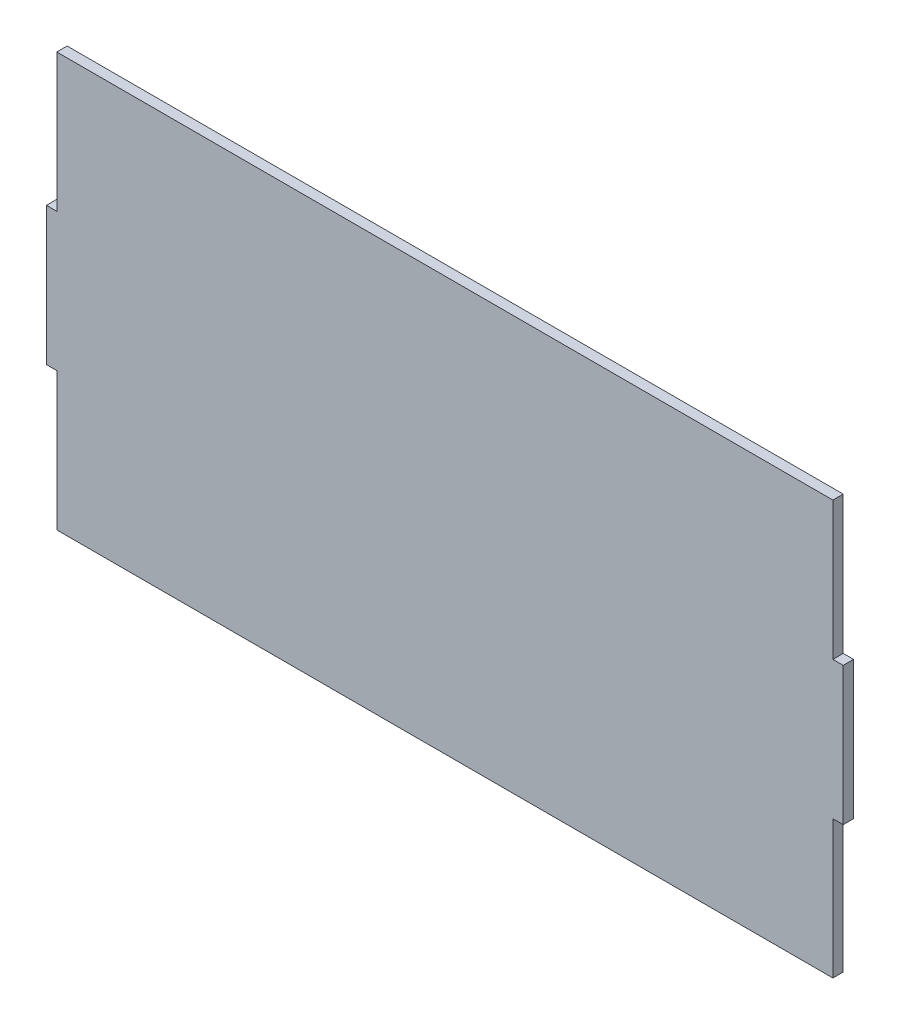
ISO-10303-21;
HEADER;
FILE_DESCRIPTION(('STEP AP214'),'2;1');
FILE_NAME('part.step','',(''),(''),'','','');
FILE_SCHEMA(('AUTOMOTIVE_DESIGN { 1 0 10303 214 1 1 1 1 }'));
ENDSEC;
DATA;
#1=APPLICATION_CONTEXT('core data for automotive mechanical design processes');
#2=APPLICATION_PROTOCOL_DEFINITION('international standard','automotive_design',2000,#1);
#3=PRODUCT_CONTEXT('',#1,'mechanical');
#4=PRODUCT('Part','Part','',(#3));
#5=PRODUCT_RELATED_PRODUCT_CATEGORY('part','',(#4));
#6=PRODUCT_DEFINITION_FORMATION('','',#4);
#7=PRODUCT_DEFINITION_CONTEXT('part definition',#1,'design');
#8=PRODUCT_DEFINITION('design','',#6,#7);
#9=PRODUCT_DEFINITION_SHAPE('','',#8);
#10=(LENGTH_UNIT() NAMED_UNIT(*) SI_UNIT(.MILLI.,.METRE.));
#11=(NAMED_UNIT(*) PLANE_ANGLE_UNIT() SI_UNIT($,.RADIAN.));
#12=(NAMED_UNIT(*) SI_UNIT($,.STERADIAN.) SOLID_ANGLE_UNIT());
#13=UNCERTAINTY_MEASURE_WITH_UNIT(LENGTH_MEASURE(1.E-05),#10,'distance_accuracy_value','');
#14=(GEOMETRIC_REPRESENTATION_CONTEXT(3) GLOBAL_UNCERTAINTY_ASSIGNED_CONTEXT((#13)) GLOBAL_UNIT_ASSIGNED_CONTEXT((#10,
#11,#12)) REPRESENTATION_CONTEXT('',''));
#15=CARTESIAN_POINT('',(0.,0.,0.));
#16=DIRECTION('',(0.,0.,1.));
#17=DIRECTION('',(1.,0.,0.));
#18=AXIS2_PLACEMENT_3D('',#15,#16,#17);
#19=CARTESIAN_POINT('',(112.5,-20.,3.));
#20=DIRECTION('',(-1.,0.,0.));
#21=DIRECTION('',(0.,0.,1.));
#22=AXIS2_PLACEMENT_3D('',#19,#20,#21);
#23=PLANE('',#22);
#24=DIRECTION('',(0.,1.,0.));
#25=VECTOR('',#24,1.);
#26=CARTESIAN_POINT('',(112.5,-20.,0.));
#27=LINE('',#26,#25);
#28=CARTESIAN_POINT('',(112.5,-60.,0.));
#29=VERTEX_POINT('',#28);
#30=CARTESIAN_POINT('',(112.5,-20.,0.));
#31=VERTEX_POINT('',#30);
#32=EDGE_CURVE('E154',#29,#31,#27,.T.);
#33=ORIENTED_EDGE('',*,*,#32,.T.);
#34=DIRECTION('',(0.,0.,-1.));
#35=VECTOR('',#34,1.);
#36=CARTESIAN_POINT('',(112.5,-20.,3.));
#37=LINE('',#36,#35);
#38=CARTESIAN_POINT('',(112.5,-20.,3.));
#39=VERTEX_POINT('',#38);
#40=EDGE_CURVE('E11',#39,#31,#37,.T.);
#41=ORIENTED_EDGE('',*,*,#40,.F.);
#42=DIRECTION('',(0.,1.,0.));
#43=VECTOR('',#42,1.);
#44=CARTESIAN_POINT('',(112.5,-20.,3.));
#45=LINE('',#44,#43);
#46=CARTESIAN_POINT('',(112.5,-60.,3.));
#47=VERTEX_POINT('',#46);
#48=EDGE_CURVE('E176',#47,#39,#45,.T.);
#49=ORIENTED_EDGE('',*,*,#48,.F.);
#50=DIRECTION('',(0.,0.,-1.));
#51=VECTOR('',#50,1.);
#52=CARTESIAN_POINT('',(112.5,-60.,3.));
#53=LINE('',#52,#51);
#54=EDGE_CURVE('E150',#47,#29,#53,.T.);
#55=ORIENTED_EDGE('',*,*,#54,.T.);
#56=EDGE_LOOP('',(#33,#41,#49,#55));
#57=FACE_BOUND('',#56,.T.);
#58=ADVANCED_FACE('F34',(#57),#23,.F.);
#59=CARTESIAN_POINT('',(115.5,-20.,3.));
#60=DIRECTION('',(0.,1.,0.));
#61=DIRECTION('',(-1.,0.,0.));
#62=AXIS2_PLACEMENT_3D('',#59,#60,#61);
#63=PLANE('',#62);
#64=DIRECTION('',(1.,0.,0.));
#65=VECTOR('',#64,1.);
#66=CARTESIAN_POINT('',(115.5,-20.,0.));
#67=LINE('',#66,#65);
#68=CARTESIAN_POINT('',(115.5,-20.,0.));
#69=VERTEX_POINT('',#68);
#70=EDGE_CURVE('E157',#31,#69,#67,.T.);
#71=ORIENTED_EDGE('',*,*,#70,.T.);
#72=DIRECTION('',(0.,0.,-1.));
#73=VECTOR('',#72,1.);
#74=CARTESIAN_POINT('',(115.5,-20.,3.));
#75=LINE('',#74,#73);
#76=CARTESIAN_POINT('',(115.5,-20.,3.));
#77=VERTEX_POINT('',#76);
#78=EDGE_CURVE('E42',#77,#69,#75,.T.);
#79=ORIENTED_EDGE('',*,*,#78,.F.);
#80=DIRECTION('',(1.,0.,0.));
#81=VECTOR('',#80,1.);
#82=CARTESIAN_POINT('',(115.5,-20.,3.));
#83=LINE('',#82,#81);
#84=EDGE_CURVE('E105',#39,#77,#83,.T.);
#85=ORIENTED_EDGE('',*,*,#84,.F.);
#86=ORIENTED_EDGE('',*,*,#40,.T.);
#87=EDGE_LOOP('',(#71,#79,#85,#86));
#88=FACE_BOUND('',#87,.T.);
#89=ADVANCED_FACE('F254',(#88),#63,.F.);
#90=CARTESIAN_POINT('',(115.5,20.,3.));
#91=DIRECTION('',(-1.,0.,0.));
#92=DIRECTION('',(0.,0.,1.));
#93=AXIS2_PLACEMENT_3D('',#90,#91,#92);
#94=PLANE('',#93);
#95=DIRECTION('',(0.,1.,0.));
#96=VECTOR('',#95,1.);
#97=CARTESIAN_POINT('',(115.5,20.,0.));
#98=LINE('',#97,#96);
#99=CARTESIAN_POINT('',(115.5,20.,0.));
#100=VERTEX_POINT('',#99);
#101=EDGE_CURVE('E159',#69,#100,#98,.T.);
#102=ORIENTED_EDGE('',*,*,#101,.T.);
#103=DIRECTION('',(0.,0.,-1.));
#104=VECTOR('',#103,1.);
#105=CARTESIAN_POINT('',(115.5,20.,3.));
#106=LINE('',#105,#104);
#107=CARTESIAN_POINT('',(115.5,20.,3.));
#108=VERTEX_POINT('',#107);
#109=EDGE_CURVE('E195',#108,#100,#106,.T.);
#110=ORIENTED_EDGE('',*,*,#109,.F.);
#111=DIRECTION('',(0.,1.,0.));
#112=VECTOR('',#111,1.);
#113=CARTESIAN_POINT('',(115.5,20.,3.));
#114=LINE('',#113,#112);
#115=EDGE_CURVE('E203',#77,#108,#114,.T.);
#116=ORIENTED_EDGE('',*,*,#115,.F.);
#117=ORIENTED_EDGE('',*,*,#78,.T.);
#118=EDGE_LOOP('',(#102,#110,#116,#117));
#119=FACE_BOUND('',#118,.T.);
#120=ADVANCED_FACE('F201',(#119),#94,.F.);
#121=CARTESIAN_POINT('',(112.5,20.,3.));
#122=DIRECTION('',(0.,-1.,0.));
#123=DIRECTION('',(1.,0.,0.));
#124=AXIS2_PLACEMENT_3D('',#121,#122,#123);
#125=PLANE('',#124);
#126=DIRECTION('',(-1.,0.,0.));
#127=VECTOR('',#126,1.);
#128=CARTESIAN_POINT('',(112.5,20.,0.));
#129=LINE('',#128,#127);
#130=CARTESIAN_POINT('',(112.5,20.,0.));
#131=VERTEX_POINT('',#130);
#132=EDGE_CURVE('E161',#100,#131,#129,.T.);
#133=ORIENTED_EDGE('',*,*,#132,.T.);
#134=DIRECTION('',(0.,0.,-1.));
#135=VECTOR('',#134,1.);
#136=CARTESIAN_POINT('',(112.5,20.,3.));
#137=LINE('',#136,#135);
#138=CARTESIAN_POINT('',(112.5,20.,3.));
#139=VERTEX_POINT('',#138);
#140=EDGE_CURVE('E192',#139,#131,#137,.T.);
#141=ORIENTED_EDGE('',*,*,#140,.F.);
#142=DIRECTION('',(-1.,0.,0.));
#143=VECTOR('',#142,1.);
#144=CARTESIAN_POINT('',(112.5,20.,3.));
#145=LINE('',#144,#143);
#146=EDGE_CURVE('E221',#108,#139,#145,.T.);
#147=ORIENTED_EDGE('',*,*,#146,.F.);
#148=ORIENTED_EDGE('',*,*,#109,.T.);
#149=EDGE_LOOP('',(#133,#141,#147,#148));
#150=FACE_BOUND('',#149,.T.);
#151=ADVANCED_FACE('F212',(#150),#125,.F.);
#152=CARTESIAN_POINT('',(112.5,60.,3.));
#153=DIRECTION('',(-1.,0.,0.));
#154=DIRECTION('',(0.,0.,1.));
#155=AXIS2_PLACEMENT_3D('',#152,#153,#154);
#156=PLANE('',#155);
#157=DIRECTION('',(0.,1.,0.));
#158=VECTOR('',#157,1.);
#159=CARTESIAN_POINT('',(112.5,60.,0.));
#160=LINE('',#159,#158);
#161=CARTESIAN_POINT('',(112.5,60.,0.));
#162=VERTEX_POINT('',#161);
#163=EDGE_CURVE('E163',#131,#162,#160,.T.);
#164=ORIENTED_EDGE('',*,*,#163,.T.);
#165=DIRECTION('',(0.,0.,-1.));
#166=VECTOR('',#165,1.);
#167=CARTESIAN_POINT('',(112.5,60.,3.));
#168=LINE('',#167,#166);
#169=CARTESIAN_POINT('',(112.5,60.,3.));
#170=VERTEX_POINT('',#169);
#171=EDGE_CURVE('E189',#170,#162,#168,.T.);
#172=ORIENTED_EDGE('',*,*,#171,.F.);
#173=DIRECTION('',(0.,1.,0.));
#174=VECTOR('',#173,1.);
#175=CARTESIAN_POINT('',(112.5,60.,3.));
#176=LINE('',#175,#174);
#177=EDGE_CURVE('E218',#139,#170,#176,.T.);
#178=ORIENTED_EDGE('',*,*,#177,.F.);
#179=ORIENTED_EDGE('',*,*,#140,.T.);
#180=EDGE_LOOP('',(#164,#172,#178,#179));
#181=FACE_BOUND('',#180,.T.);
#182=ADVANCED_FACE('F216',(#181),#156,.F.);
#183=CARTESIAN_POINT('',(-112.5,60.,3.));
#184=DIRECTION('',(0.,-1.,0.));
#185=DIRECTION('',(0.,0.,-1.));
#186=AXIS2_PLACEMENT_3D('',#183,#184,#185);
#187=PLANE('',#186);
#188=DIRECTION('',(-1.,0.,0.));
#189=VECTOR('',#188,1.);
#190=CARTESIAN_POINT('',(-112.5,60.,0.));
#191=LINE('',#190,#189);
#192=CARTESIAN_POINT('',(-112.5,60.,0.));
#193=VERTEX_POINT('',#192);
#194=EDGE_CURVE('E165',#162,#193,#191,.T.);
#195=ORIENTED_EDGE('',*,*,#194,.T.);
#196=DIRECTION('',(0.,0.,-1.));
#197=VECTOR('',#196,1.);
#198=CARTESIAN_POINT('',(-112.5,60.,3.));
#199=LINE('',#198,#197);
#200=CARTESIAN_POINT('',(-112.5,60.,3.));
#201=VERTEX_POINT('',#200);
#202=EDGE_CURVE('E186',#201,#193,#199,.T.);
#203=ORIENTED_EDGE('',*,*,#202,.F.);
#204=DIRECTION('',(-1.,0.,0.));
#205=VECTOR('',#204,1.);
#206=CARTESIAN_POINT('',(-112.5,60.,3.));
#207=LINE('',#206,#205);
#208=EDGE_CURVE('E220',#170,#201,#207,.T.);
#209=ORIENTED_EDGE('',*,*,#208,.F.);
#210=ORIENTED_EDGE('',*,*,#171,.T.);
#211=EDGE_LOOP('',(#195,#203,#209,#210));
#212=FACE_BOUND('',#211,.T.);
#213=ADVANCED_FACE('F267',(#212),#187,.F.);
#214=CARTESIAN_POINT('',(-112.5,60.,3.));
#215=DIRECTION('',(1.,0.,0.));
#216=DIRECTION('',(0.,0.,-1.));
#217=AXIS2_PLACEMENT_3D('',#214,#215,#216);
#218=PLANE('',#217);
#219=DIRECTION('',(0.,-1.,0.));
#220=VECTOR('',#219,1.);
#221=CARTESIAN_POINT('',(-112.5,60.,0.));
#222=LINE('',#221,#220);
#223=CARTESIAN_POINT('',(-112.5,20.,0.));
#224=VERTEX_POINT('',#223);
#225=EDGE_CURVE('E167',#193,#224,#222,.T.);
#226=ORIENTED_EDGE('',*,*,#225,.T.);
#227=DIRECTION('',(0.,0.,-1.));
#228=VECTOR('',#227,1.);
#229=CARTESIAN_POINT('',(-112.5,20.,3.));
#230=LINE('',#229,#228);
#231=CARTESIAN_POINT('',(-112.5,20.,3.));
#232=VERTEX_POINT('',#231);
#233=EDGE_CURVE('E183',#232,#224,#230,.T.);
#234=ORIENTED_EDGE('',*,*,#233,.F.);
#235=DIRECTION('',(0.,-1.,0.));
#236=VECTOR('',#235,1.);
#237=CARTESIAN_POINT('',(-112.5,60.,3.));
#238=LINE('',#237,#236);
#239=EDGE_CURVE('E223',#201,#232,#238,.T.);
#240=ORIENTED_EDGE('',*,*,#239,.F.);
#241=ORIENTED_EDGE('',*,*,#202,.T.);
#242=EDGE_LOOP('',(#226,#234,#240,#241));
#243=FACE_BOUND('',#242,.T.);
#244=ADVANCED_FACE('F270',(#243),#218,.F.);
#245=CARTESIAN_POINT('',(-112.5,20.,3.));
#246=DIRECTION('',(0.,-1.,0.));
#247=DIRECTION('',(0.,0.,-1.));
#248=AXIS2_PLACEMENT_3D('',#245,#246,#247);
#249=PLANE('',#248);
#250=DIRECTION('',(-1.,0.,0.));
#251=VECTOR('',#250,1.);
#252=CARTESIAN_POINT('',(-112.5,20.,0.));
#253=LINE('',#252,#251);
#254=CARTESIAN_POINT('',(-115.5,20.,0.));
#255=VERTEX_POINT('',#254);
#256=EDGE_CURVE('E169',#224,#255,#253,.T.);
#257=ORIENTED_EDGE('',*,*,#256,.T.);
#258=DIRECTION('',(0.,0.,-1.));
#259=VECTOR('',#258,1.);
#260=CARTESIAN_POINT('',(-115.5,20.,3.));
#261=LINE('',#260,#259);
#262=CARTESIAN_POINT('',(-115.5,20.,3.));
#263=VERTEX_POINT('',#262);
#264=EDGE_CURVE('E180',#263,#255,#261,.T.);
#265=ORIENTED_EDGE('',*,*,#264,.F.);
#266=DIRECTION('',(-1.,0.,0.));
#267=VECTOR('',#266,1.);
#268=CARTESIAN_POINT('',(-112.5,20.,3.));
#269=LINE('',#268,#267);
#270=EDGE_CURVE('E229',#232,#263,#269,.T.);
#271=ORIENTED_EDGE('',*,*,#270,.F.);
#272=ORIENTED_EDGE('',*,*,#233,.T.);
#273=EDGE_LOOP('',(#257,#265,#271,#272));
#274=FACE_BOUND('',#273,.T.);
#275=ADVANCED_FACE('F235',(#274),#249,.F.);
#276=CARTESIAN_POINT('',(-115.5,20.,3.));
#277=DIRECTION('',(1.,0.,0.));
#278=DIRECTION('',(0.,0.,-1.));
#279=AXIS2_PLACEMENT_3D('',#276,#277,#278);
#280=PLANE('',#279);
#281=DIRECTION('',(0.,-1.,0.));
#282=VECTOR('',#281,1.);
#283=CARTESIAN_POINT('',(-115.5,20.,0.));
#284=LINE('',#283,#282);
#285=CARTESIAN_POINT('',(-115.5,-20.,0.));
#286=VERTEX_POINT('',#285);
#287=EDGE_CURVE('E171',#255,#286,#284,.T.);
#288=ORIENTED_EDGE('',*,*,#287,.T.);
#289=DIRECTION('',(0.,0.,-1.));
#290=VECTOR('',#289,1.);
#291=CARTESIAN_POINT('',(-115.5,-20.,3.));
#292=LINE('',#291,#290);
#293=CARTESIAN_POINT('',(-115.5,-20.,3.));
#294=VERTEX_POINT('',#293);
#295=EDGE_CURVE('E145',#294,#286,#292,.T.);
#296=ORIENTED_EDGE('',*,*,#295,.F.);
#297=DIRECTION('',(0.,-1.,0.));
#298=VECTOR('',#297,1.);
#299=CARTESIAN_POINT('',(-115.5,20.,3.));
#300=LINE('',#299,#298);
#301=EDGE_CURVE('E136',#263,#294,#300,.T.);
#302=ORIENTED_EDGE('',*,*,#301,.F.);
#303=ORIENTED_EDGE('',*,*,#264,.T.);
#304=EDGE_LOOP('',(#288,#296,#302,#303));
#305=FACE_BOUND('',#304,.T.);
#306=ADVANCED_FACE('F239',(#305),#280,.F.);
#307=CARTESIAN_POINT('',(-115.5,-20.,3.));
#308=DIRECTION('',(0.,1.,0.));
#309=DIRECTION('',(0.,0.,1.));
#310=AXIS2_PLACEMENT_3D('',#307,#308,#309);
#311=PLANE('',#310);
#312=DIRECTION('',(1.,0.,0.));
#313=VECTOR('',#312,1.);
#314=CARTESIAN_POINT('',(-115.5,-20.,0.));
#315=LINE('',#314,#313);
#316=CARTESIAN_POINT('',(-112.5,-20.,0.));
#317=VERTEX_POINT('',#316);
#318=EDGE_CURVE('E144',#286,#317,#315,.T.);
#319=ORIENTED_EDGE('',*,*,#318,.T.);
#320=DIRECTION('',(0.,0.,-1.));
#321=VECTOR('',#320,1.);
#322=CARTESIAN_POINT('',(-112.5,-20.,3.));
#323=LINE('',#322,#321);
#324=CARTESIAN_POINT('',(-112.5,-20.,3.));
#325=VERTEX_POINT('',#324);
#326=EDGE_CURVE('E141',#325,#317,#323,.T.);
#327=ORIENTED_EDGE('',*,*,#326,.F.);
#328=DIRECTION('',(1.,0.,0.));
#329=VECTOR('',#328,1.);
#330=CARTESIAN_POINT('',(-115.5,-20.,3.));
#331=LINE('',#330,#329);
#332=EDGE_CURVE('E130',#294,#325,#331,.T.);
#333=ORIENTED_EDGE('',*,*,#332,.F.);
#334=ORIENTED_EDGE('',*,*,#295,.T.);
#335=EDGE_LOOP('',(#319,#327,#333,#334));
#336=FACE_BOUND('',#335,.T.);
#337=ADVANCED_FACE('F142',(#336),#311,.F.);
#338=CARTESIAN_POINT('',(-112.5,-20.,3.));
#339=DIRECTION('',(1.,0.,0.));
#340=DIRECTION('',(0.,1.,0.));
#341=AXIS2_PLACEMENT_3D('',#338,#339,#340);
#342=PLANE('',#341);
#343=DIRECTION('',(0.,-1.,0.));
#344=VECTOR('',#343,1.);
#345=CARTESIAN_POINT('',(-112.5,-20.,0.));
#346=LINE('',#345,#344);
#347=CARTESIAN_POINT('',(-112.5,-60.,0.));
#348=VERTEX_POINT('',#347);
#349=EDGE_CURVE('E91',#317,#348,#346,.T.);
#350=ORIENTED_EDGE('',*,*,#349,.T.);
#351=DIRECTION('',(0.,0.,-1.));
#352=VECTOR('',#351,1.);
#353=CARTESIAN_POINT('',(-112.5,-60.,3.));
#354=LINE('',#353,#352);
#355=CARTESIAN_POINT('',(-112.5,-60.,3.));
#356=VERTEX_POINT('',#355);
#357=EDGE_CURVE('E146',#356,#348,#354,.T.);
#358=ORIENTED_EDGE('',*,*,#357,.F.);
#359=DIRECTION('',(0.,-1.,0.));
#360=VECTOR('',#359,1.);
#361=CARTESIAN_POINT('',(-112.5,-20.,3.));
#362=LINE('',#361,#360);
#363=EDGE_CURVE('E134',#325,#356,#362,.T.);
#364=ORIENTED_EDGE('',*,*,#363,.F.);
#365=ORIENTED_EDGE('',*,*,#326,.T.);
#366=EDGE_LOOP('',(#350,#358,#364,#365));
#367=FACE_BOUND('',#366,.T.);
#368=ADVANCED_FACE('F148',(#367),#342,.F.);
#369=CARTESIAN_POINT('',(-112.5,-60.,3.));
#370=DIRECTION('',(0.,1.,0.));
#371=DIRECTION('',(0.,0.,1.));
#372=AXIS2_PLACEMENT_3D('',#369,#370,#371);
#373=PLANE('',#372);
#374=DIRECTION('',(1.,0.,0.));
#375=VECTOR('',#374,1.);
#376=CARTESIAN_POINT('',(-112.5,-60.,0.));
#377=LINE('',#376,#375);
#378=EDGE_CURVE('E97',#348,#29,#377,.T.);
#379=ORIENTED_EDGE('',*,*,#378,.T.);
#380=ORIENTED_EDGE('',*,*,#54,.F.);
#381=DIRECTION('',(1.,0.,0.));
#382=VECTOR('',#381,1.);
#383=CARTESIAN_POINT('',(-112.5,-60.,3.));
#384=LINE('',#383,#382);
#385=EDGE_CURVE('E50',#356,#47,#384,.T.);
#386=ORIENTED_EDGE('',*,*,#385,.F.);
#387=ORIENTED_EDGE('',*,*,#357,.T.);
#388=EDGE_LOOP('',(#379,#380,#386,#387));
#389=FACE_BOUND('',#388,.T.);
#390=ADVANCED_FACE('F243',(#389),#373,.F.);
#391=CARTESIAN_POINT('',(0.,0.,3.));
#392=DIRECTION('',(0.,0.,1.));
#393=DIRECTION('',(1.,0.,0.));
#394=AXIS2_PLACEMENT_3D('',#391,#392,#393);
#395=PLANE('',#394);
#396=ORIENTED_EDGE('',*,*,#48,.T.);
#397=ORIENTED_EDGE('',*,*,#84,.T.);
#398=ORIENTED_EDGE('',*,*,#115,.T.);
#399=ORIENTED_EDGE('',*,*,#146,.T.);
#400=ORIENTED_EDGE('',*,*,#177,.T.);
#401=ORIENTED_EDGE('',*,*,#208,.T.);
#402=ORIENTED_EDGE('',*,*,#239,.T.);
#403=ORIENTED_EDGE('',*,*,#270,.T.);
#404=ORIENTED_EDGE('',*,*,#301,.T.);
#405=ORIENTED_EDGE('',*,*,#332,.T.);
#406=ORIENTED_EDGE('',*,*,#363,.T.);
#407=ORIENTED_EDGE('',*,*,#385,.T.);
#408=EDGE_LOOP('',(#396,#397,#398,#399,#400,#401,#402,#403,#404,#405,#406,#407));
#409=FACE_BOUND('',#408,.T.);
#410=ADVANCED_FACE('F132',(#409),#395,.T.);
#411=CARTESIAN_POINT('',(0.,0.,0.));
#412=DIRECTION('',(0.,0.,1.));
#413=DIRECTION('',(1.,0.,0.));
#414=AXIS2_PLACEMENT_3D('',#411,#412,#413);
#415=PLANE('',#414);
#416=ORIENTED_EDGE('',*,*,#32,.F.);
#417=ORIENTED_EDGE('',*,*,#378,.F.);
#418=ORIENTED_EDGE('',*,*,#349,.F.);
#419=ORIENTED_EDGE('',*,*,#318,.F.);
#420=ORIENTED_EDGE('',*,*,#287,.F.);
#421=ORIENTED_EDGE('',*,*,#256,.F.);
#422=ORIENTED_EDGE('',*,*,#225,.F.);
#423=ORIENTED_EDGE('',*,*,#194,.F.);
#424=ORIENTED_EDGE('',*,*,#163,.F.);
#425=ORIENTED_EDGE('',*,*,#132,.F.);
#426=ORIENTED_EDGE('',*,*,#101,.F.);
#427=ORIENTED_EDGE('',*,*,#70,.F.);
#428=EDGE_LOOP('',(#416,#417,#418,#419,#420,#421,#422,#423,#424,#425,#426,#427));
#429=FACE_BOUND('',#428,.T.);
#430=ADVANCED_FACE('F207',(#429),#415,.F.);
#431=CLOSED_SHELL('',(#58,#89,#120,#151,#182,#213,#244,#275,#306,#337,#368,#390,#410,#430));
#432=MANIFOLD_SOLID_BREP('B2',#431);
#433=ADVANCED_BREP_SHAPE_REPRESENTATION('',(#18,#432),#14);
#434=SHAPE_DEFINITION_REPRESENTATION(#9,#433);
ENDSEC;
END-ISO-10303-21;
